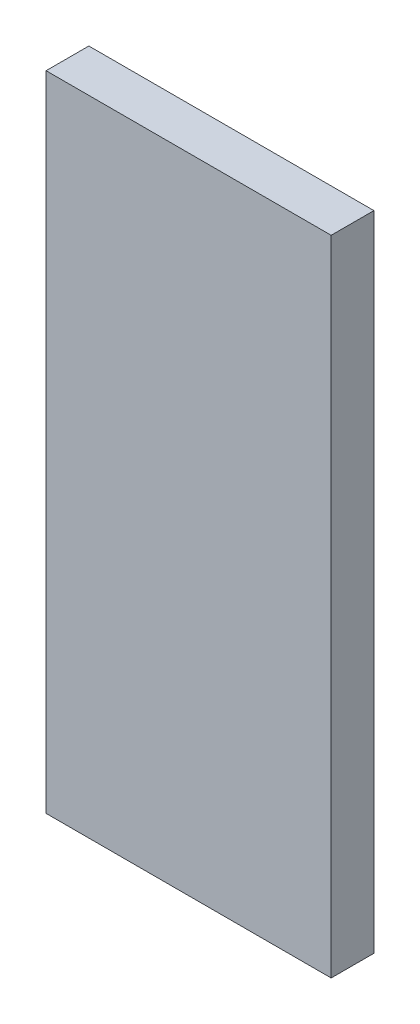
ISO-10303-21;
HEADER;
FILE_DESCRIPTION(('STEP AP214'),'2;1');
FILE_NAME('part.step','',(''),(''),'','','');
FILE_SCHEMA(('AUTOMOTIVE_DESIGN { 1 0 10303 214 1 1 1 1 }'));
ENDSEC;
DATA;
#1=APPLICATION_CONTEXT('core data for automotive mechanical design processes');
#2=APPLICATION_PROTOCOL_DEFINITION('international standard','automotive_design',2000,#1);
#3=PRODUCT_CONTEXT('',#1,'mechanical');
#4=PRODUCT('Part','Part','',(#3));
#5=PRODUCT_RELATED_PRODUCT_CATEGORY('part','',(#4));
#6=PRODUCT_DEFINITION_FORMATION('','',#4);
#7=PRODUCT_DEFINITION_CONTEXT('part definition',#1,'design');
#8=PRODUCT_DEFINITION('design','',#6,#7);
#9=PRODUCT_DEFINITION_SHAPE('','',#8);
#10=(LENGTH_UNIT() NAMED_UNIT(*) SI_UNIT(.MILLI.,.METRE.));
#11=(NAMED_UNIT(*) PLANE_ANGLE_UNIT() SI_UNIT($,.RADIAN.));
#12=(NAMED_UNIT(*) SI_UNIT($,.STERADIAN.) SOLID_ANGLE_UNIT());
#13=UNCERTAINTY_MEASURE_WITH_UNIT(LENGTH_MEASURE(1.E-05),#10,'distance_accuracy_value','');
#14=(GEOMETRIC_REPRESENTATION_CONTEXT(3) GLOBAL_UNCERTAINTY_ASSIGNED_CONTEXT((#13)) GLOBAL_UNIT_ASSIGNED_CONTEXT((#10,
#11,#12)) REPRESENTATION_CONTEXT('',''));
#15=CARTESIAN_POINT('',(0.,0.,0.));
#16=DIRECTION('',(0.,0.,1.));
#17=DIRECTION('',(1.,0.,0.));
#18=AXIS2_PLACEMENT_3D('',#15,#16,#17);
#19=CARTESIAN_POINT('',(40.,-90.25,12.));
#20=DIRECTION('',(-1.,0.,0.));
#21=DIRECTION('',(0.,0.,1.));
#22=AXIS2_PLACEMENT_3D('',#19,#20,#21);
#23=PLANE('',#22);
#24=DIRECTION('',(0.,1.,0.));
#25=VECTOR('',#24,1.);
#26=CARTESIAN_POINT('',(40.,-90.25,0.));
#27=LINE('',#26,#25);
#28=CARTESIAN_POINT('',(40.,-90.25,0.));
#29=VERTEX_POINT('',#28);
#30=CARTESIAN_POINT('',(40.,90.25,0.));
#31=VERTEX_POINT('',#30);
#32=EDGE_CURVE('E96',#29,#31,#27,.T.);
#33=ORIENTED_EDGE('',*,*,#32,.T.);
#34=DIRECTION('',(0.,0.,-1.));
#35=VECTOR('',#34,1.);
#36=CARTESIAN_POINT('',(40.,90.25,12.));
#37=LINE('',#36,#35);
#38=CARTESIAN_POINT('',(40.,90.25,12.));
#39=VERTEX_POINT('',#38);
#40=EDGE_CURVE('E11',#39,#31,#37,.T.);
#41=ORIENTED_EDGE('',*,*,#40,.F.);
#42=DIRECTION('',(0.,1.,0.));
#43=VECTOR('',#42,1.);
#44=CARTESIAN_POINT('',(40.,-90.25,12.));
#45=LINE('',#44,#43);
#46=CARTESIAN_POINT('',(40.,-90.25,12.));
#47=VERTEX_POINT('',#46);
#48=EDGE_CURVE('E84',#47,#39,#45,.T.);
#49=ORIENTED_EDGE('',*,*,#48,.F.);
#50=DIRECTION('',(0.,0.,-1.));
#51=VECTOR('',#50,1.);
#52=CARTESIAN_POINT('',(40.,-90.25,12.));
#53=LINE('',#52,#51);
#54=EDGE_CURVE('E92',#47,#29,#53,.T.);
#55=ORIENTED_EDGE('',*,*,#54,.T.);
#56=EDGE_LOOP('',(#33,#41,#49,#55));
#57=FACE_BOUND('',#56,.T.);
#58=ADVANCED_FACE('F33',(#57),#23,.F.);
#59=CARTESIAN_POINT('',(-40.,90.25,12.));
#60=DIRECTION('',(0.,-1.,0.));
#61=DIRECTION('',(0.,0.,-1.));
#62=AXIS2_PLACEMENT_3D('',#59,#60,#61);
#63=PLANE('',#62);
#64=DIRECTION('',(-1.,0.,0.));
#65=VECTOR('',#64,1.);
#66=CARTESIAN_POINT('',(-40.,90.25,0.));
#67=LINE('',#66,#65);
#68=CARTESIAN_POINT('',(-40.,90.25,0.));
#69=VERTEX_POINT('',#68);
#70=EDGE_CURVE('E88',#31,#69,#67,.T.);
#71=ORIENTED_EDGE('',*,*,#70,.T.);
#72=DIRECTION('',(0.,0.,-1.));
#73=VECTOR('',#72,1.);
#74=CARTESIAN_POINT('',(-40.,90.25,12.));
#75=LINE('',#74,#73);
#76=CARTESIAN_POINT('',(-40.,90.25,12.));
#77=VERTEX_POINT('',#76);
#78=EDGE_CURVE('E41',#77,#69,#75,.T.);
#79=ORIENTED_EDGE('',*,*,#78,.F.);
#80=DIRECTION('',(-1.,0.,0.));
#81=VECTOR('',#80,1.);
#82=CARTESIAN_POINT('',(-40.,90.25,12.));
#83=LINE('',#82,#81);
#84=EDGE_CURVE('E79',#39,#77,#83,.T.);
#85=ORIENTED_EDGE('',*,*,#84,.F.);
#86=ORIENTED_EDGE('',*,*,#40,.T.);
#87=EDGE_LOOP('',(#71,#79,#85,#86));
#88=FACE_BOUND('',#87,.T.);
#89=ADVANCED_FACE('F87',(#88),#63,.F.);
#90=CARTESIAN_POINT('',(-40.,-90.25,12.));
#91=DIRECTION('',(1.,0.,0.));
#92=DIRECTION('',(0.,0.,-1.));
#93=AXIS2_PLACEMENT_3D('',#90,#91,#92);
#94=PLANE('',#93);
#95=DIRECTION('',(0.,-1.,0.));
#96=VECTOR('',#95,1.);
#97=CARTESIAN_POINT('',(-40.,-90.25,0.));
#98=LINE('',#97,#96);
#99=CARTESIAN_POINT('',(-40.,-90.25,0.));
#100=VERTEX_POINT('',#99);
#101=EDGE_CURVE('E66',#69,#100,#98,.T.);
#102=ORIENTED_EDGE('',*,*,#101,.T.);
#103=DIRECTION('',(0.,0.,-1.));
#104=VECTOR('',#103,1.);
#105=CARTESIAN_POINT('',(-40.,-90.25,12.));
#106=LINE('',#105,#104);
#107=CARTESIAN_POINT('',(-40.,-90.25,12.));
#108=VERTEX_POINT('',#107);
#109=EDGE_CURVE('E89',#108,#100,#106,.T.);
#110=ORIENTED_EDGE('',*,*,#109,.F.);
#111=DIRECTION('',(0.,-1.,0.));
#112=VECTOR('',#111,1.);
#113=CARTESIAN_POINT('',(-40.,-90.25,12.));
#114=LINE('',#113,#112);
#115=EDGE_CURVE('E82',#77,#108,#114,.T.);
#116=ORIENTED_EDGE('',*,*,#115,.F.);
#117=ORIENTED_EDGE('',*,*,#78,.T.);
#118=EDGE_LOOP('',(#102,#110,#116,#117));
#119=FACE_BOUND('',#118,.T.);
#120=ADVANCED_FACE('F90',(#119),#94,.F.);
#121=CARTESIAN_POINT('',(-40.,-90.25,12.));
#122=DIRECTION('',(0.,1.,0.));
#123=DIRECTION('',(0.,0.,1.));
#124=AXIS2_PLACEMENT_3D('',#121,#122,#123);
#125=PLANE('',#124);
#126=DIRECTION('',(1.,0.,0.));
#127=VECTOR('',#126,1.);
#128=CARTESIAN_POINT('',(-40.,-90.25,0.));
#129=LINE('',#128,#127);
#130=EDGE_CURVE('E72',#100,#29,#129,.T.);
#131=ORIENTED_EDGE('',*,*,#130,.T.);
#132=ORIENTED_EDGE('',*,*,#54,.F.);
#133=DIRECTION('',(1.,0.,0.));
#134=VECTOR('',#133,1.);
#135=CARTESIAN_POINT('',(-40.,-90.25,12.));
#136=LINE('',#135,#134);
#137=EDGE_CURVE('E49',#108,#47,#136,.T.);
#138=ORIENTED_EDGE('',*,*,#137,.F.);
#139=ORIENTED_EDGE('',*,*,#109,.T.);
#140=EDGE_LOOP('',(#131,#132,#138,#139));
#141=FACE_BOUND('',#140,.T.);
#142=ADVANCED_FACE('F103',(#141),#125,.F.);
#143=CARTESIAN_POINT('',(0.,0.,12.));
#144=DIRECTION('',(0.,0.,-1.));
#145=DIRECTION('',(-1.,0.,0.));
#146=AXIS2_PLACEMENT_3D('',#143,#144,#145);
#147=PLANE('',#146);
#148=ORIENTED_EDGE('',*,*,#48,.T.);
#149=ORIENTED_EDGE('',*,*,#84,.T.);
#150=ORIENTED_EDGE('',*,*,#115,.T.);
#151=ORIENTED_EDGE('',*,*,#137,.T.);
#152=EDGE_LOOP('',(#148,#149,#150,#151));
#153=FACE_BOUND('',#152,.T.);
#154=ADVANCED_FACE('F80',(#153),#147,.F.);
#155=CARTESIAN_POINT('',(0.,0.,0.));
#156=DIRECTION('',(0.,0.,-1.));
#157=DIRECTION('',(-1.,0.,0.));
#158=AXIS2_PLACEMENT_3D('',#155,#156,#157);
#159=PLANE('',#158);
#160=ORIENTED_EDGE('',*,*,#32,.F.);
#161=ORIENTED_EDGE('',*,*,#130,.F.);
#162=ORIENTED_EDGE('',*,*,#101,.F.);
#163=ORIENTED_EDGE('',*,*,#70,.F.);
#164=EDGE_LOOP('',(#160,#161,#162,#163));
#165=FACE_BOUND('',#164,.T.);
#166=ADVANCED_FACE('F106',(#165),#159,.T.);
#167=CLOSED_SHELL('',(#58,#89,#120,#142,#154,#166));
#168=MANIFOLD_SOLID_BREP('B2',#167);
#169=ADVANCED_BREP_SHAPE_REPRESENTATION('',(#18,#168),#14);
#170=SHAPE_DEFINITION_REPRESENTATION(#9,#169);
ENDSEC;
END-ISO-10303-21;
